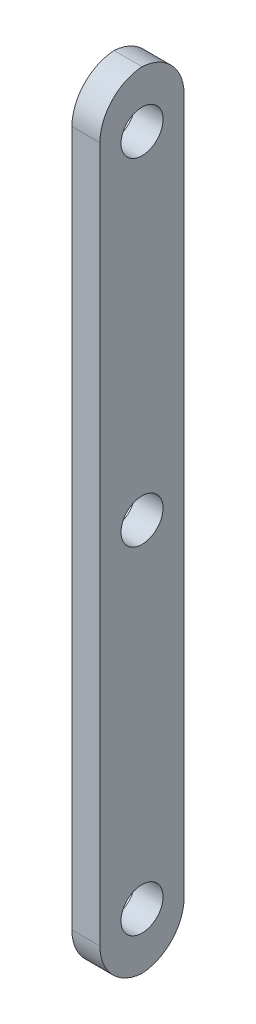
ISO-10303-21;
HEADER;
FILE_DESCRIPTION(('STEP AP214'),'2;1');
FILE_NAME('part.step','',(''),(''),'','','');
FILE_SCHEMA(('AUTOMOTIVE_DESIGN { 1 0 10303 214 1 1 1 1 }'));
ENDSEC;
DATA;
#1=APPLICATION_CONTEXT('core data for automotive mechanical design processes');
#2=APPLICATION_PROTOCOL_DEFINITION('international standard','automotive_design',2000,#1);
#3=PRODUCT_CONTEXT('',#1,'mechanical');
#4=PRODUCT('Part','Part','',(#3));
#5=PRODUCT_RELATED_PRODUCT_CATEGORY('part','',(#4));
#6=PRODUCT_DEFINITION_FORMATION('','',#4);
#7=PRODUCT_DEFINITION_CONTEXT('part definition',#1,'design');
#8=PRODUCT_DEFINITION('design','',#6,#7);
#9=PRODUCT_DEFINITION_SHAPE('','',#8);
#10=(LENGTH_UNIT() NAMED_UNIT(*) SI_UNIT(.MILLI.,.METRE.));
#11=(NAMED_UNIT(*) PLANE_ANGLE_UNIT() SI_UNIT($,.RADIAN.));
#12=(NAMED_UNIT(*) SI_UNIT($,.STERADIAN.) SOLID_ANGLE_UNIT());
#13=UNCERTAINTY_MEASURE_WITH_UNIT(LENGTH_MEASURE(1.E-05),#10,'distance_accuracy_value','');
#14=(GEOMETRIC_REPRESENTATION_CONTEXT(3) GLOBAL_UNCERTAINTY_ASSIGNED_CONTEXT((#13)) GLOBAL_UNIT_ASSIGNED_CONTEXT((#10,
#11,#12)) REPRESENTATION_CONTEXT('',''));
#15=CARTESIAN_POINT('',(0.,0.,0.));
#16=DIRECTION('',(0.,0.,1.));
#17=DIRECTION('',(1.,0.,0.));
#18=AXIS2_PLACEMENT_3D('',#15,#16,#17);
#19=CARTESIAN_POINT('',(5.,0.,0.));
#20=DIRECTION('',(-1.,0.,0.));
#21=DIRECTION('',(0.,0.,1.));
#22=AXIS2_PLACEMENT_3D('',#19,#20,#21);
#23=PLANE('',#22);
#24=DIRECTION('',(0.,-1.,0.));
#25=VECTOR('',#24,1.);
#26=CARTESIAN_POINT('',(5.,-70.,7.5));
#27=LINE('',#26,#25);
#28=CARTESIAN_POINT('',(5.,62.,7.5));
#29=VERTEX_POINT('',#28);
#30=CARTESIAN_POINT('',(5.,-62.,7.5));
#31=VERTEX_POINT('',#30);
#32=EDGE_CURVE('E146',#29,#31,#27,.T.);
#33=ORIENTED_EDGE('',*,*,#32,.T.);
#34=CARTESIAN_POINT('',(5.,-62.,-0.5));
#35=DIRECTION('',(-1.,0.,0.));
#36=DIRECTION('',(0.,0.,1.));
#37=AXIS2_PLACEMENT_3D('',#34,#35,#36);
#38=CIRCLE('',#37,8.);
#39=CARTESIAN_POINT('',(5.,-69.9843597113357,0.));
#40=VERTEX_POINT('',#39);
#41=EDGE_CURVE('E55',#31,#40,#38,.F.);
#42=ORIENTED_EDGE('',*,*,#41,.T.);
#43=CARTESIAN_POINT('',(5.,-62.,0.5));
#44=DIRECTION('',(-1.,0.,0.));
#45=DIRECTION('',(0.,0.,1.));
#46=AXIS2_PLACEMENT_3D('',#43,#44,#45);
#47=CIRCLE('',#46,8.);
#48=CARTESIAN_POINT('',(5.,-62.,-7.5));
#49=VERTEX_POINT('',#48);
#50=EDGE_CURVE('E129',#40,#49,#47,.F.);
#51=ORIENTED_EDGE('',*,*,#50,.T.);
#52=DIRECTION('',(0.,1.,0.));
#53=VECTOR('',#52,1.);
#54=CARTESIAN_POINT('',(5.,-70.,-7.5));
#55=LINE('',#54,#53);
#56=CARTESIAN_POINT('',(5.,62.,-7.5));
#57=VERTEX_POINT('',#56);
#58=EDGE_CURVE('E97',#49,#57,#55,.T.);
#59=ORIENTED_EDGE('',*,*,#58,.T.);
#60=CARTESIAN_POINT('',(5.,62.,0.5));
#61=DIRECTION('',(-1.,0.,0.));
#62=DIRECTION('',(0.,0.,1.));
#63=AXIS2_PLACEMENT_3D('',#60,#61,#62);
#64=CIRCLE('',#63,8.);
#65=CARTESIAN_POINT('',(5.,69.9843597113357,0.));
#66=VERTEX_POINT('',#65);
#67=EDGE_CURVE('E62',#57,#66,#64,.F.);
#68=ORIENTED_EDGE('',*,*,#67,.T.);
#69=CARTESIAN_POINT('',(5.,62.,-0.5));
#70=DIRECTION('',(-1.,0.,0.));
#71=DIRECTION('',(0.,0.,1.));
#72=AXIS2_PLACEMENT_3D('',#69,#70,#71);
#73=CIRCLE('',#72,8.);
#74=EDGE_CURVE('E126',#66,#29,#73,.F.);
#75=ORIENTED_EDGE('',*,*,#74,.T.);
#76=EDGE_LOOP('',(#33,#42,#51,#59,#68,#75));
#77=FACE_BOUND('',#76,.T.);
#78=CARTESIAN_POINT('',(5.,0.,0.));
#79=DIRECTION('',(1.,0.,0.));
#80=DIRECTION('',(0.,0.,-1.));
#81=AXIS2_PLACEMENT_3D('',#78,#79,#80);
#82=CIRCLE('',#81,3.75);
#83=CARTESIAN_POINT('',(5.,0.,-3.75));
#84=VERTEX_POINT('',#83);
#85=EDGE_CURVE('E108',#84,#84,#82,.T.);
#86=ORIENTED_EDGE('',*,*,#85,.F.);
#87=EDGE_LOOP('',(#86));
#88=FACE_BOUND('',#87,.T.);
#89=CARTESIAN_POINT('',(5.,60.,0.));
#90=DIRECTION('',(1.,0.,0.));
#91=DIRECTION('',(0.,0.,-1.));
#92=AXIS2_PLACEMENT_3D('',#89,#90,#91);
#93=CIRCLE('',#92,3.75);
#94=CARTESIAN_POINT('',(5.,60.,-3.75));
#95=VERTEX_POINT('',#94);
#96=EDGE_CURVE('E259',#95,#95,#93,.T.);
#97=ORIENTED_EDGE('',*,*,#96,.F.);
#98=EDGE_LOOP('',(#97));
#99=FACE_BOUND('',#98,.T.);
#100=CARTESIAN_POINT('',(5.,-60.,0.));
#101=DIRECTION('',(1.,0.,0.));
#102=DIRECTION('',(0.,0.,-1.));
#103=AXIS2_PLACEMENT_3D('',#100,#101,#102);
#104=CIRCLE('',#103,3.75);
#105=CARTESIAN_POINT('',(5.,-60.,-3.75));
#106=VERTEX_POINT('',#105);
#107=EDGE_CURVE('E135',#106,#106,#104,.T.);
#108=ORIENTED_EDGE('',*,*,#107,.F.);
#109=EDGE_LOOP('',(#108));
#110=FACE_BOUND('',#109,.T.);
#111=ADVANCED_FACE('F38',(#77,#88,#99,#110),#23,.F.);
#112=CARTESIAN_POINT('',(0.,0.,0.));
#113=DIRECTION('',(-1.,0.,0.));
#114=DIRECTION('',(0.,0.,1.));
#115=AXIS2_PLACEMENT_3D('',#112,#113,#114);
#116=PLANE('',#115);
#117=CARTESIAN_POINT('',(0.,60.,0.));
#118=DIRECTION('',(1.,0.,0.));
#119=DIRECTION('',(0.,0.,-1.));
#120=AXIS2_PLACEMENT_3D('',#117,#118,#119);
#121=CIRCLE('',#120,3.75);
#122=CARTESIAN_POINT('',(0.,60.,-3.75));
#123=VERTEX_POINT('',#122);
#124=EDGE_CURVE('E256',#123,#123,#121,.T.);
#125=ORIENTED_EDGE('',*,*,#124,.T.);
#126=EDGE_LOOP('',(#125));
#127=FACE_BOUND('',#126,.T.);
#128=CARTESIAN_POINT('',(0.,-62.,0.5));
#129=DIRECTION('',(-1.,0.,0.));
#130=DIRECTION('',(0.,0.,1.));
#131=AXIS2_PLACEMENT_3D('',#128,#129,#130);
#132=CIRCLE('',#131,8.);
#133=CARTESIAN_POINT('',(0.,-62.,-7.5));
#134=VERTEX_POINT('',#133);
#135=CARTESIAN_POINT('',(0.,-69.9843597113357,0.));
#136=VERTEX_POINT('',#135);
#137=EDGE_CURVE('E103',#134,#136,#132,.T.);
#138=ORIENTED_EDGE('',*,*,#137,.T.);
#139=CARTESIAN_POINT('',(0.,-62.,-0.5));
#140=DIRECTION('',(-1.,0.,0.));
#141=DIRECTION('',(0.,0.,1.));
#142=AXIS2_PLACEMENT_3D('',#139,#140,#141);
#143=CIRCLE('',#142,8.);
#144=CARTESIAN_POINT('',(0.,-62.,7.5));
#145=VERTEX_POINT('',#144);
#146=EDGE_CURVE('E114',#136,#145,#143,.T.);
#147=ORIENTED_EDGE('',*,*,#146,.T.);
#148=DIRECTION('',(0.,-1.,0.));
#149=VECTOR('',#148,1.);
#150=CARTESIAN_POINT('',(0.,-70.,7.5));
#151=LINE('',#150,#149);
#152=CARTESIAN_POINT('',(0.,62.,7.5));
#153=VERTEX_POINT('',#152);
#154=EDGE_CURVE('E107',#153,#145,#151,.T.);
#155=ORIENTED_EDGE('',*,*,#154,.F.);
#156=CARTESIAN_POINT('',(0.,62.,-0.5));
#157=DIRECTION('',(-1.,0.,0.));
#158=DIRECTION('',(0.,0.,1.));
#159=AXIS2_PLACEMENT_3D('',#156,#157,#158);
#160=CIRCLE('',#159,8.);
#161=CARTESIAN_POINT('',(0.,69.9843597113357,0.));
#162=VERTEX_POINT('',#161);
#163=EDGE_CURVE('E118',#153,#162,#160,.T.);
#164=ORIENTED_EDGE('',*,*,#163,.T.);
#165=CARTESIAN_POINT('',(0.,62.,0.5));
#166=DIRECTION('',(-1.,0.,0.));
#167=DIRECTION('',(0.,0.,1.));
#168=AXIS2_PLACEMENT_3D('',#165,#166,#167);
#169=CIRCLE('',#168,8.);
#170=CARTESIAN_POINT('',(0.,62.,-7.5));
#171=VERTEX_POINT('',#170);
#172=EDGE_CURVE('E106',#162,#171,#169,.T.);
#173=ORIENTED_EDGE('',*,*,#172,.T.);
#174=DIRECTION('',(0.,1.,0.));
#175=VECTOR('',#174,1.);
#176=CARTESIAN_POINT('',(0.,-70.,-7.5));
#177=LINE('',#176,#175);
#178=EDGE_CURVE('E95',#134,#171,#177,.T.);
#179=ORIENTED_EDGE('',*,*,#178,.F.);
#180=EDGE_LOOP('',(#138,#147,#155,#164,#173,#179));
#181=FACE_BOUND('',#180,.T.);
#182=CARTESIAN_POINT('',(0.,0.,0.));
#183=DIRECTION('',(1.,0.,0.));
#184=DIRECTION('',(0.,0.,-1.));
#185=AXIS2_PLACEMENT_3D('',#182,#183,#184);
#186=CIRCLE('',#185,3.75);
#187=CARTESIAN_POINT('',(0.,0.,-3.75));
#188=VERTEX_POINT('',#187);
#189=EDGE_CURVE('E263',#188,#188,#186,.T.);
#190=ORIENTED_EDGE('',*,*,#189,.T.);
#191=EDGE_LOOP('',(#190));
#192=FACE_BOUND('',#191,.T.);
#193=CARTESIAN_POINT('',(0.,-60.,0.));
#194=DIRECTION('',(1.,0.,0.));
#195=DIRECTION('',(0.,0.,-1.));
#196=AXIS2_PLACEMENT_3D('',#193,#194,#195);
#197=CIRCLE('',#196,3.75);
#198=CARTESIAN_POINT('',(0.,-60.,-3.75));
#199=VERTEX_POINT('',#198);
#200=EDGE_CURVE('E132',#199,#199,#197,.T.);
#201=ORIENTED_EDGE('',*,*,#200,.T.);
#202=EDGE_LOOP('',(#201));
#203=FACE_BOUND('',#202,.T.);
#204=ADVANCED_FACE('F101',(#127,#181,#192,#203),#116,.T.);
#205=CARTESIAN_POINT('',(5.,-70.,-7.5));
#206=DIRECTION('',(0.,0.,1.));
#207=DIRECTION('',(1.,0.,0.));
#208=AXIS2_PLACEMENT_3D('',#205,#206,#207);
#209=PLANE('',#208);
#210=ORIENTED_EDGE('',*,*,#58,.F.);
#211=DIRECTION('',(-1.,0.,0.));
#212=VECTOR('',#211,1.);
#213=CARTESIAN_POINT('',(5.,-62.,-7.5));
#214=LINE('',#213,#212);
#215=EDGE_CURVE('E11',#49,#134,#214,.T.);
#216=ORIENTED_EDGE('',*,*,#215,.T.);
#217=ORIENTED_EDGE('',*,*,#178,.T.);
#218=DIRECTION('',(-1.,0.,0.));
#219=VECTOR('',#218,1.);
#220=CARTESIAN_POINT('',(5.,62.,-7.5));
#221=LINE('',#220,#219);
#222=EDGE_CURVE('E47',#171,#57,#221,.F.);
#223=ORIENTED_EDGE('',*,*,#222,.T.);
#224=EDGE_LOOP('',(#210,#216,#217,#223));
#225=FACE_BOUND('',#224,.T.);
#226=ADVANCED_FACE('F93',(#225),#209,.F.);
#227=CARTESIAN_POINT('',(5.,-70.,7.5));
#228=DIRECTION('',(0.,0.,-1.));
#229=DIRECTION('',(-1.,0.,0.));
#230=AXIS2_PLACEMENT_3D('',#227,#228,#229);
#231=PLANE('',#230);
#232=ORIENTED_EDGE('',*,*,#154,.T.);
#233=DIRECTION('',(-1.,0.,0.));
#234=VECTOR('',#233,1.);
#235=CARTESIAN_POINT('',(5.,-62.,7.5));
#236=LINE('',#235,#234);
#237=EDGE_CURVE('E123',#145,#31,#236,.F.);
#238=ORIENTED_EDGE('',*,*,#237,.T.);
#239=ORIENTED_EDGE('',*,*,#32,.F.);
#240=DIRECTION('',(-1.,0.,0.));
#241=VECTOR('',#240,1.);
#242=CARTESIAN_POINT('',(5.,62.,7.5));
#243=LINE('',#242,#241);
#244=EDGE_CURVE('E116',#29,#153,#243,.T.);
#245=ORIENTED_EDGE('',*,*,#244,.T.);
#246=EDGE_LOOP('',(#232,#238,#239,#245));
#247=FACE_BOUND('',#246,.T.);
#248=ADVANCED_FACE('F149',(#247),#231,.F.);
#249=CARTESIAN_POINT('',(5.,0.,0.));
#250=DIRECTION('',(-1.,0.,0.));
#251=DIRECTION('',(0.,0.,1.));
#252=AXIS2_PLACEMENT_3D('',#249,#250,#251);
#253=CYLINDRICAL_SURFACE('',#252,3.75);
#254=ORIENTED_EDGE('',*,*,#85,.T.);
#255=EDGE_LOOP('',(#254));
#256=FACE_BOUND('',#255,.T.);
#257=ORIENTED_EDGE('',*,*,#189,.F.);
#258=EDGE_LOOP('',(#257));
#259=FACE_BOUND('',#258,.T.);
#260=ADVANCED_FACE('F174',(#256,#259),#253,.F.);
#261=CARTESIAN_POINT('',(5.,60.,0.));
#262=DIRECTION('',(-1.,0.,0.));
#263=DIRECTION('',(0.,0.,1.));
#264=AXIS2_PLACEMENT_3D('',#261,#262,#263);
#265=CYLINDRICAL_SURFACE('',#264,3.75);
#266=ORIENTED_EDGE('',*,*,#96,.T.);
#267=EDGE_LOOP('',(#266));
#268=FACE_BOUND('',#267,.T.);
#269=ORIENTED_EDGE('',*,*,#124,.F.);
#270=EDGE_LOOP('',(#269));
#271=FACE_BOUND('',#270,.T.);
#272=ADVANCED_FACE('F194',(#268,#271),#265,.F.);
#273=CARTESIAN_POINT('',(5.,-60.,0.));
#274=DIRECTION('',(-1.,0.,0.));
#275=DIRECTION('',(0.,0.,1.));
#276=AXIS2_PLACEMENT_3D('',#273,#274,#275);
#277=CYLINDRICAL_SURFACE('',#276,3.75);
#278=ORIENTED_EDGE('',*,*,#107,.T.);
#279=EDGE_LOOP('',(#278));
#280=FACE_BOUND('',#279,.T.);
#281=ORIENTED_EDGE('',*,*,#200,.F.);
#282=EDGE_LOOP('',(#281));
#283=FACE_BOUND('',#282,.T.);
#284=ADVANCED_FACE('F163',(#280,#283),#277,.F.);
#285=CARTESIAN_POINT('',(5.,-62.,0.5));
#286=DIRECTION('',(-1.,0.,0.));
#287=DIRECTION('',(0.,0.,1.));
#288=AXIS2_PLACEMENT_3D('',#285,#286,#287);
#289=CYLINDRICAL_SURFACE('',#288,8.);
#290=ORIENTED_EDGE('',*,*,#215,.F.);
#291=ORIENTED_EDGE('',*,*,#50,.F.);
#292=DIRECTION('',(-1.,0.,0.));
#293=VECTOR('',#292,1.);
#294=CARTESIAN_POINT('',(2.5,-69.9843597113357,0.));
#295=LINE('',#294,#293);
#296=EDGE_CURVE('E112',#136,#40,#295,.F.);
#297=ORIENTED_EDGE('',*,*,#296,.F.);
#298=ORIENTED_EDGE('',*,*,#137,.F.);
#299=EDGE_LOOP('',(#290,#291,#297,#298));
#300=FACE_BOUND('',#299,.T.);
#301=ADVANCED_FACE('F110',(#300),#289,.T.);
#302=CARTESIAN_POINT('',(5.,-62.,-0.5));
#303=DIRECTION('',(-1.,0.,0.));
#304=DIRECTION('',(0.,0.,1.));
#305=AXIS2_PLACEMENT_3D('',#302,#303,#304);
#306=CYLINDRICAL_SURFACE('',#305,8.);
#307=ORIENTED_EDGE('',*,*,#41,.F.);
#308=ORIENTED_EDGE('',*,*,#237,.F.);
#309=ORIENTED_EDGE('',*,*,#146,.F.);
#310=ORIENTED_EDGE('',*,*,#296,.T.);
#311=EDGE_LOOP('',(#307,#308,#309,#310));
#312=FACE_BOUND('',#311,.T.);
#313=ADVANCED_FACE('F156',(#312),#306,.T.);
#314=CARTESIAN_POINT('',(5.,62.,-0.5));
#315=DIRECTION('',(-1.,0.,0.));
#316=DIRECTION('',(0.,0.,1.));
#317=AXIS2_PLACEMENT_3D('',#314,#315,#316);
#318=CYLINDRICAL_SURFACE('',#317,8.);
#319=ORIENTED_EDGE('',*,*,#244,.F.);
#320=ORIENTED_EDGE('',*,*,#74,.F.);
#321=DIRECTION('',(-1.,0.,0.));
#322=VECTOR('',#321,1.);
#323=CARTESIAN_POINT('',(2.5,69.9843597113357,0.));
#324=LINE('',#323,#322);
#325=EDGE_CURVE('E42',#162,#66,#324,.F.);
#326=ORIENTED_EDGE('',*,*,#325,.F.);
#327=ORIENTED_EDGE('',*,*,#163,.F.);
#328=EDGE_LOOP('',(#319,#320,#326,#327));
#329=FACE_BOUND('',#328,.T.);
#330=ADVANCED_FACE('F40',(#329),#318,.T.);
#331=CARTESIAN_POINT('',(5.,62.,0.5));
#332=DIRECTION('',(-1.,0.,0.));
#333=DIRECTION('',(0.,0.,1.));
#334=AXIS2_PLACEMENT_3D('',#331,#332,#333);
#335=CYLINDRICAL_SURFACE('',#334,8.);
#336=ORIENTED_EDGE('',*,*,#67,.F.);
#337=ORIENTED_EDGE('',*,*,#222,.F.);
#338=ORIENTED_EDGE('',*,*,#172,.F.);
#339=ORIENTED_EDGE('',*,*,#325,.T.);
#340=EDGE_LOOP('',(#336,#337,#338,#339));
#341=FACE_BOUND('',#340,.T.);
#342=ADVANCED_FACE('F140',(#341),#335,.T.);
#343=CLOSED_SHELL('',(#111,#204,#226,#248,#260,#272,#284,#301,#313,#330,#342));
#344=MANIFOLD_SOLID_BREP('B2',#343);
#345=ADVANCED_BREP_SHAPE_REPRESENTATION('',(#18,#344),#14);
#346=SHAPE_DEFINITION_REPRESENTATION(#9,#345);
ENDSEC;
END-ISO-10303-21;
